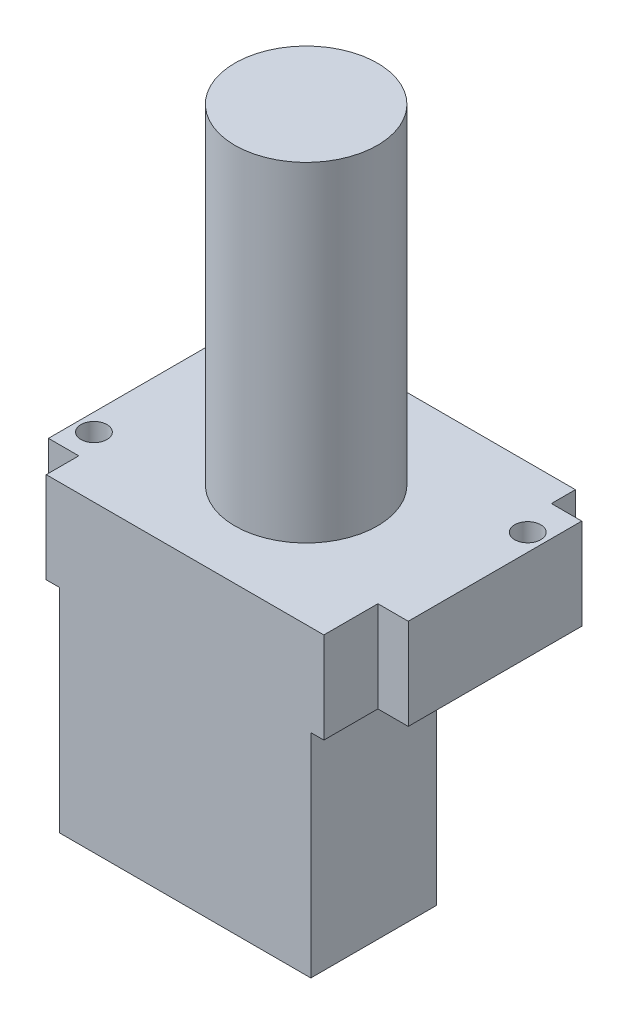
ISO-10303-21;
HEADER;
FILE_DESCRIPTION(('STEP AP214'),'2;1');
FILE_NAME('part.step','',(''),(''),'','','');
FILE_SCHEMA(('AUTOMOTIVE_DESIGN { 1 0 10303 214 1 1 1 1 }'));
ENDSEC;
DATA;
#1=APPLICATION_CONTEXT('core data for automotive mechanical design processes');
#2=APPLICATION_PROTOCOL_DEFINITION('international standard','automotive_design',2000,#1);
#3=PRODUCT_CONTEXT('',#1,'mechanical');
#4=PRODUCT('Part','Part','',(#3));
#5=PRODUCT_RELATED_PRODUCT_CATEGORY('part','',(#4));
#6=PRODUCT_DEFINITION_FORMATION('','',#4);
#7=PRODUCT_DEFINITION_CONTEXT('part definition',#1,'design');
#8=PRODUCT_DEFINITION('design','',#6,#7);
#9=PRODUCT_DEFINITION_SHAPE('','',#8);
#10=(LENGTH_UNIT() NAMED_UNIT(*) SI_UNIT(.MILLI.,.METRE.));
#11=(NAMED_UNIT(*) PLANE_ANGLE_UNIT() SI_UNIT($,.RADIAN.));
#12=(NAMED_UNIT(*) SI_UNIT($,.STERADIAN.) SOLID_ANGLE_UNIT());
#13=UNCERTAINTY_MEASURE_WITH_UNIT(LENGTH_MEASURE(1.E-05),#10,'distance_accuracy_value','');
#14=(GEOMETRIC_REPRESENTATION_CONTEXT(3) GLOBAL_UNCERTAINTY_ASSIGNED_CONTEXT((#13)) GLOBAL_UNIT_ASSIGNED_CONTEXT((#10,
#11,#12)) REPRESENTATION_CONTEXT('',''));
#15=CARTESIAN_POINT('',(0.,0.,0.));
#16=DIRECTION('',(0.,0.,1.));
#17=DIRECTION('',(1.,0.,0.));
#18=AXIS2_PLACEMENT_3D('',#15,#16,#17);
#19=CARTESIAN_POINT('',(-16.,35.,-21.75));
#20=DIRECTION('',(1.,0.,0.));
#21=DIRECTION('',(0.,0.,-1.));
#22=AXIS2_PLACEMENT_3D('',#19,#20,#21);
#23=PLANE('',#22);
#24=DIRECTION('',(0.,-1.,0.));
#25=VECTOR('',#24,1.);
#26=CARTESIAN_POINT('',(-16.,24.5,-16.5030809884463));
#27=LINE('',#26,#25);
#28=CARTESIAN_POINT('',(-16.,35.,-16.5030809884463));
#29=VERTEX_POINT('',#28);
#30=CARTESIAN_POINT('',(-16.,24.5,-16.5030809884463));
#31=VERTEX_POINT('',#30);
#32=EDGE_CURVE('E48',#29,#31,#27,.T.);
#33=ORIENTED_EDGE('',*,*,#32,.F.);
#34=DIRECTION('',(0.,0.,1.));
#35=VECTOR('',#34,1.);
#36=CARTESIAN_POINT('',(-16.,35.,-21.75));
#37=LINE('',#36,#35);
#38=CARTESIAN_POINT('',(-16.,35.,-21.75));
#39=VERTEX_POINT('',#38);
#40=EDGE_CURVE('E210',#39,#29,#37,.T.);
#41=ORIENTED_EDGE('',*,*,#40,.F.);
#42=DIRECTION('',(0.,-1.,0.));
#43=VECTOR('',#42,1.);
#44=CARTESIAN_POINT('',(-16.,35.,-21.75));
#45=LINE('',#44,#43);
#46=CARTESIAN_POINT('',(-16.,24.5,-21.75));
#47=VERTEX_POINT('',#46);
#48=EDGE_CURVE('E231',#39,#47,#45,.T.);
#49=ORIENTED_EDGE('',*,*,#48,.T.);
#50=DIRECTION('',(0.,0.,1.));
#51=VECTOR('',#50,1.);
#52=CARTESIAN_POINT('',(-16.,24.5,-21.75));
#53=LINE('',#52,#51);
#54=EDGE_CURVE('E220',#47,#31,#53,.T.);
#55=ORIENTED_EDGE('',*,*,#54,.T.);
#56=EDGE_LOOP('',(#33,#41,#49,#55));
#57=FACE_BOUND('',#56,.T.);
#58=ADVANCED_FACE('F33',(#57),#23,.F.);
#59=DIRECTION('',(0.,1.,0.));
#60=VECTOR('',#59,1.);
#61=CARTESIAN_POINT('',(-16.,24.5,3.49691901155367));
#62=LINE('',#61,#60);
#63=CARTESIAN_POINT('',(-16.,24.5,3.49691901155367));
#64=VERTEX_POINT('',#63);
#65=CARTESIAN_POINT('',(-16.,35.,3.49691901155367));
#66=VERTEX_POINT('',#65);
#67=EDGE_CURVE('E56',#64,#66,#62,.T.);
#68=ORIENTED_EDGE('',*,*,#67,.F.);
#69=CARTESIAN_POINT('',(-16.,24.5,7.25));
#70=VERTEX_POINT('',#69);
#71=EDGE_CURVE('E219',#64,#70,#53,.T.);
#72=ORIENTED_EDGE('',*,*,#71,.T.);
#73=DIRECTION('',(0.,-1.,0.));
#74=VECTOR('',#73,1.);
#75=CARTESIAN_POINT('',(-16.,35.,7.25));
#76=LINE('',#75,#74);
#77=CARTESIAN_POINT('',(-16.,35.,7.25));
#78=VERTEX_POINT('',#77);
#79=EDGE_CURVE('E228',#78,#70,#76,.T.);
#80=ORIENTED_EDGE('',*,*,#79,.F.);
#81=EDGE_CURVE('E209',#66,#78,#37,.T.);
#82=ORIENTED_EDGE('',*,*,#81,.F.);
#83=EDGE_LOOP('',(#68,#72,#80,#82));
#84=FACE_BOUND('',#83,.T.);
#85=ADVANCED_FACE('F365',(#84),#23,.F.);
#86=CARTESIAN_POINT('',(16.,35.,-21.75));
#87=DIRECTION('',(-1.,0.,0.));
#88=DIRECTION('',(0.,0.,1.));
#89=AXIS2_PLACEMENT_3D('',#86,#87,#88);
#90=PLANE('',#89);
#91=DIRECTION('',(0.,1.,0.));
#92=VECTOR('',#91,1.);
#93=CARTESIAN_POINT('',(16.,35.,-18.978907638751));
#94=LINE('',#93,#92);
#95=CARTESIAN_POINT('',(16.,24.5,-18.978907638751));
#96=VERTEX_POINT('',#95);
#97=CARTESIAN_POINT('',(16.,35.,-18.978907638751));
#98=VERTEX_POINT('',#97);
#99=EDGE_CURVE('E170',#96,#98,#94,.T.);
#100=ORIENTED_EDGE('',*,*,#99,.F.);
#101=DIRECTION('',(0.,0.,-1.));
#102=VECTOR('',#101,1.);
#103=CARTESIAN_POINT('',(16.,24.5,-21.75));
#104=LINE('',#103,#102);
#105=CARTESIAN_POINT('',(16.,24.5,-21.75));
#106=VERTEX_POINT('',#105);
#107=EDGE_CURVE('E202',#96,#106,#104,.T.);
#108=ORIENTED_EDGE('',*,*,#107,.T.);
#109=DIRECTION('',(0.,-1.,0.));
#110=VECTOR('',#109,1.);
#111=CARTESIAN_POINT('',(16.,35.,-21.75));
#112=LINE('',#111,#110);
#113=CARTESIAN_POINT('',(16.,35.,-21.75));
#114=VERTEX_POINT('',#113);
#115=EDGE_CURVE('E234',#114,#106,#112,.T.);
#116=ORIENTED_EDGE('',*,*,#115,.F.);
#117=DIRECTION('',(0.,0.,-1.));
#118=VECTOR('',#117,1.);
#119=CARTESIAN_POINT('',(16.,35.,-21.75));
#120=LINE('',#119,#118);
#121=EDGE_CURVE('E207',#98,#114,#120,.T.);
#122=ORIENTED_EDGE('',*,*,#121,.F.);
#123=EDGE_LOOP('',(#100,#108,#116,#122));
#124=FACE_BOUND('',#123,.T.);
#125=ADVANCED_FACE('F299',(#124),#90,.F.);
#126=DIRECTION('',(0.,-1.,0.));
#127=VECTOR('',#126,1.);
#128=CARTESIAN_POINT('',(16.,35.,1.02109236124903));
#129=LINE('',#128,#127);
#130=CARTESIAN_POINT('',(16.,35.,1.02109236124903));
#131=VERTEX_POINT('',#130);
#132=CARTESIAN_POINT('',(16.,24.5,1.02109236124903));
#133=VERTEX_POINT('',#132);
#134=EDGE_CURVE('E173',#131,#133,#129,.T.);
#135=ORIENTED_EDGE('',*,*,#134,.F.);
#136=CARTESIAN_POINT('',(16.,35.,7.25));
#137=VERTEX_POINT('',#136);
#138=EDGE_CURVE('E203',#137,#131,#120,.T.);
#139=ORIENTED_EDGE('',*,*,#138,.F.);
#140=DIRECTION('',(0.,-1.,0.));
#141=VECTOR('',#140,1.);
#142=CARTESIAN_POINT('',(16.,35.,7.25));
#143=LINE('',#142,#141);
#144=CARTESIAN_POINT('',(16.,24.5,7.25));
#145=VERTEX_POINT('',#144);
#146=EDGE_CURVE('E214',#137,#145,#143,.T.);
#147=ORIENTED_EDGE('',*,*,#146,.T.);
#148=EDGE_CURVE('E215',#145,#133,#104,.T.);
#149=ORIENTED_EDGE('',*,*,#148,.T.);
#150=EDGE_LOOP('',(#135,#139,#147,#149));
#151=FACE_BOUND('',#150,.T.);
#152=ADVANCED_FACE('F280',(#151),#90,.F.);
#153=CARTESIAN_POINT('',(14.5,24.5,-7.25));
#154=DIRECTION('',(-1.,0.,0.));
#155=DIRECTION('',(0.,0.,1.));
#156=AXIS2_PLACEMENT_3D('',#153,#154,#155);
#157=PLANE('',#156);
#158=DIRECTION('',(0.,0.,-1.));
#159=VECTOR('',#158,1.);
#160=CARTESIAN_POINT('',(14.5,0.,-7.25));
#161=LINE('',#160,#159);
#162=CARTESIAN_POINT('',(14.5,0.,7.25));
#163=VERTEX_POINT('',#162);
#164=CARTESIAN_POINT('',(14.5,0.,-7.25));
#165=VERTEX_POINT('',#164);
#166=EDGE_CURVE('E237',#163,#165,#161,.T.);
#167=ORIENTED_EDGE('',*,*,#166,.T.);
#168=DIRECTION('',(0.,-1.,0.));
#169=VECTOR('',#168,1.);
#170=CARTESIAN_POINT('',(14.5,24.5,-7.25));
#171=LINE('',#170,#169);
#172=CARTESIAN_POINT('',(14.5,24.5,-7.25));
#173=VERTEX_POINT('',#172);
#174=EDGE_CURVE('E11',#173,#165,#171,.T.);
#175=ORIENTED_EDGE('',*,*,#174,.F.);
#176=DIRECTION('',(0.,0.,-1.));
#177=VECTOR('',#176,1.);
#178=CARTESIAN_POINT('',(14.5,24.5,-7.25));
#179=LINE('',#178,#177);
#180=CARTESIAN_POINT('',(14.5,24.5,7.25));
#181=VERTEX_POINT('',#180);
#182=EDGE_CURVE('E238',#181,#173,#179,.T.);
#183=ORIENTED_EDGE('',*,*,#182,.F.);
#184=DIRECTION('',(0.,-1.,0.));
#185=VECTOR('',#184,1.);
#186=CARTESIAN_POINT('',(14.5,24.5,7.25));
#187=LINE('',#186,#185);
#188=EDGE_CURVE('E248',#181,#163,#187,.T.);
#189=ORIENTED_EDGE('',*,*,#188,.T.);
#190=EDGE_LOOP('',(#167,#175,#183,#189));
#191=FACE_BOUND('',#190,.T.);
#192=ADVANCED_FACE('F35',(#191),#157,.F.);
#193=CARTESIAN_POINT('',(-14.5,24.5,-7.25));
#194=DIRECTION('',(0.,0.,1.));
#195=DIRECTION('',(1.,0.,0.));
#196=AXIS2_PLACEMENT_3D('',#193,#194,#195);
#197=PLANE('',#196);
#198=DIRECTION('',(-1.,0.,0.));
#199=VECTOR('',#198,1.);
#200=CARTESIAN_POINT('',(-14.5,0.,-7.25));
#201=LINE('',#200,#199);
#202=CARTESIAN_POINT('',(-14.5,0.,-7.25));
#203=VERTEX_POINT('',#202);
#204=EDGE_CURVE('E251',#165,#203,#201,.T.);
#205=ORIENTED_EDGE('',*,*,#204,.T.);
#206=DIRECTION('',(0.,-1.,0.));
#207=VECTOR('',#206,1.);
#208=CARTESIAN_POINT('',(-14.5,24.5,-7.25));
#209=LINE('',#208,#207);
#210=CARTESIAN_POINT('',(-14.5,24.5,-7.25));
#211=VERTEX_POINT('',#210);
#212=EDGE_CURVE('E41',#211,#203,#209,.T.);
#213=ORIENTED_EDGE('',*,*,#212,.F.);
#214=DIRECTION('',(-1.,0.,0.));
#215=VECTOR('',#214,1.);
#216=CARTESIAN_POINT('',(-14.5,24.5,-7.25));
#217=LINE('',#216,#215);
#218=EDGE_CURVE('E241',#173,#211,#217,.T.);
#219=ORIENTED_EDGE('',*,*,#218,.F.);
#220=ORIENTED_EDGE('',*,*,#174,.T.);
#221=EDGE_LOOP('',(#205,#213,#219,#220));
#222=FACE_BOUND('',#221,.T.);
#223=ADVANCED_FACE('F375',(#222),#197,.F.);
#224=CARTESIAN_POINT('',(-14.5,24.5,-7.25));
#225=DIRECTION('',(1.,0.,0.));
#226=DIRECTION('',(0.,0.,-1.));
#227=AXIS2_PLACEMENT_3D('',#224,#225,#226);
#228=PLANE('',#227);
#229=DIRECTION('',(0.,0.,1.));
#230=VECTOR('',#229,1.);
#231=CARTESIAN_POINT('',(-14.5,0.,-7.25));
#232=LINE('',#231,#230);
#233=CARTESIAN_POINT('',(-14.5,0.,7.25));
#234=VERTEX_POINT('',#233);
#235=EDGE_CURVE('E253',#203,#234,#232,.T.);
#236=ORIENTED_EDGE('',*,*,#235,.T.);
#237=DIRECTION('',(0.,-1.,0.));
#238=VECTOR('',#237,1.);
#239=CARTESIAN_POINT('',(-14.5,24.5,7.25));
#240=LINE('',#239,#238);
#241=CARTESIAN_POINT('',(-14.5,24.5,7.25));
#242=VERTEX_POINT('',#241);
#243=EDGE_CURVE('E258',#242,#234,#240,.T.);
#244=ORIENTED_EDGE('',*,*,#243,.F.);
#245=DIRECTION('',(0.,0.,1.));
#246=VECTOR('',#245,1.);
#247=CARTESIAN_POINT('',(-14.5,24.5,-7.25));
#248=LINE('',#247,#246);
#249=EDGE_CURVE('E245',#211,#242,#248,.T.);
#250=ORIENTED_EDGE('',*,*,#249,.F.);
#251=ORIENTED_EDGE('',*,*,#212,.T.);
#252=EDGE_LOOP('',(#236,#244,#250,#251));
#253=FACE_BOUND('',#252,.T.);
#254=ADVANCED_FACE('F264',(#253),#228,.F.);
#255=CARTESIAN_POINT('',(-14.5,24.5,7.25));
#256=DIRECTION('',(0.,0.,-1.));
#257=DIRECTION('',(-1.,0.,0.));
#258=AXIS2_PLACEMENT_3D('',#255,#256,#257);
#259=PLANE('',#258);
#260=DIRECTION('',(1.,0.,0.));
#261=VECTOR('',#260,1.);
#262=CARTESIAN_POINT('',(-14.5,0.,7.25));
#263=LINE('',#262,#261);
#264=EDGE_CURVE('E242',#234,#163,#263,.T.);
#265=ORIENTED_EDGE('',*,*,#264,.T.);
#266=ORIENTED_EDGE('',*,*,#188,.F.);
#267=DIRECTION('',(1.,0.,0.));
#268=VECTOR('',#267,1.);
#269=CARTESIAN_POINT('',(-16.,24.5,7.25));
#270=LINE('',#269,#268);
#271=EDGE_CURVE('E222',#181,#145,#270,.T.);
#272=ORIENTED_EDGE('',*,*,#271,.T.);
#273=ORIENTED_EDGE('',*,*,#146,.F.);
#274=DIRECTION('',(1.,0.,0.));
#275=VECTOR('',#274,1.);
#276=CARTESIAN_POINT('',(-16.,35.,7.25));
#277=LINE('',#276,#275);
#278=EDGE_CURVE('E212',#78,#137,#277,.T.);
#279=ORIENTED_EDGE('',*,*,#278,.F.);
#280=ORIENTED_EDGE('',*,*,#79,.T.);
#281=EDGE_CURVE('E223',#70,#242,#270,.T.);
#282=ORIENTED_EDGE('',*,*,#281,.T.);
#283=ORIENTED_EDGE('',*,*,#243,.T.);
#284=EDGE_LOOP('',(#265,#266,#272,#273,#279,#280,#282,#283));
#285=FACE_BOUND('',#284,.T.);
#286=ADVANCED_FACE('F271',(#285),#259,.F.);
#287=CARTESIAN_POINT('',(0.,0.,0.));
#288=DIRECTION('',(0.,1.,0.));
#289=DIRECTION('',(0.,0.,1.));
#290=AXIS2_PLACEMENT_3D('',#287,#288,#289);
#291=PLANE('',#290);
#292=ORIENTED_EDGE('',*,*,#166,.F.);
#293=ORIENTED_EDGE('',*,*,#264,.F.);
#294=ORIENTED_EDGE('',*,*,#235,.F.);
#295=ORIENTED_EDGE('',*,*,#204,.F.);
#296=EDGE_LOOP('',(#292,#293,#294,#295));
#297=FACE_BOUND('',#296,.T.);
#298=ADVANCED_FACE('F269',(#297),#291,.F.);
#299=CARTESIAN_POINT('',(0.,24.5,0.));
#300=DIRECTION('',(0.,1.,0.));
#301=DIRECTION('',(0.,0.,1.));
#302=AXIS2_PLACEMENT_3D('',#299,#300,#301);
#303=PLANE('',#302);
#304=CARTESIAN_POINT('',(-17.5,24.5,0.249999999999999));
#305=DIRECTION('',(0.,1.,0.));
#306=DIRECTION('',(0.,0.,1.));
#307=AXIS2_PLACEMENT_3D('',#304,#305,#306);
#308=CIRCLE('',#307,1.5);
#309=CARTESIAN_POINT('',(-17.5,24.5,1.75));
#310=VERTEX_POINT('',#309);
#311=EDGE_CURVE('E319',#310,#310,#308,.T.);
#312=ORIENTED_EDGE('',*,*,#311,.T.);
#313=EDGE_LOOP('',(#312));
#314=FACE_BOUND('',#313,.T.);
#315=CARTESIAN_POINT('',(17.5,24.5,-14.75));
#316=DIRECTION('',(0.,1.,0.));
#317=DIRECTION('',(0.,0.,1.));
#318=AXIS2_PLACEMENT_3D('',#315,#316,#317);
#319=CIRCLE('',#318,1.5);
#320=CARTESIAN_POINT('',(17.5,24.5,-13.25));
#321=VERTEX_POINT('',#320);
#322=EDGE_CURVE('E311',#321,#321,#319,.T.);
#323=ORIENTED_EDGE('',*,*,#322,.T.);
#324=EDGE_LOOP('',(#323));
#325=FACE_BOUND('',#324,.T.);
#326=ORIENTED_EDGE('',*,*,#271,.F.);
#327=ORIENTED_EDGE('',*,*,#182,.T.);
#328=ORIENTED_EDGE('',*,*,#218,.T.);
#329=ORIENTED_EDGE('',*,*,#249,.T.);
#330=ORIENTED_EDGE('',*,*,#281,.F.);
#331=ORIENTED_EDGE('',*,*,#71,.F.);
#332=DIRECTION('',(1.,0.,0.));
#333=VECTOR('',#332,1.);
#334=CARTESIAN_POINT('',(-19.5,24.5,3.49691901155367));
#335=LINE('',#334,#333);
#336=CARTESIAN_POINT('',(-19.5,24.5,3.49691901155367));
#337=VERTEX_POINT('',#336);
#338=EDGE_CURVE('E155',#337,#64,#335,.T.);
#339=ORIENTED_EDGE('',*,*,#338,.F.);
#340=DIRECTION('',(0.,0.,1.));
#341=VECTOR('',#340,1.);
#342=CARTESIAN_POINT('',(-19.5,24.5,-16.5030809884463));
#343=LINE('',#342,#341);
#344=CARTESIAN_POINT('',(-19.5,24.5,-16.5030809884463));
#345=VERTEX_POINT('',#344);
#346=EDGE_CURVE('E147',#345,#337,#343,.T.);
#347=ORIENTED_EDGE('',*,*,#346,.F.);
#348=DIRECTION('',(1.,0.,0.));
#349=VECTOR('',#348,1.);
#350=CARTESIAN_POINT('',(-19.5,24.5,-16.5030809884463));
#351=LINE('',#350,#349);
#352=EDGE_CURVE('E153',#345,#31,#351,.T.);
#353=ORIENTED_EDGE('',*,*,#352,.T.);
#354=ORIENTED_EDGE('',*,*,#54,.F.);
#355=DIRECTION('',(-1.,0.,0.));
#356=VECTOR('',#355,1.);
#357=CARTESIAN_POINT('',(-16.,24.5,-21.75));
#358=LINE('',#357,#356);
#359=EDGE_CURVE('E217',#106,#47,#358,.T.);
#360=ORIENTED_EDGE('',*,*,#359,.F.);
#361=ORIENTED_EDGE('',*,*,#107,.F.);
#362=DIRECTION('',(-1.,0.,0.));
#363=VECTOR('',#362,1.);
#364=CARTESIAN_POINT('',(19.5,24.5,-18.978907638751));
#365=LINE('',#364,#363);
#366=CARTESIAN_POINT('',(19.5,24.5,-18.978907638751));
#367=VERTEX_POINT('',#366);
#368=EDGE_CURVE('E187',#367,#96,#365,.T.);
#369=ORIENTED_EDGE('',*,*,#368,.F.);
#370=DIRECTION('',(0.,0.,-1.));
#371=VECTOR('',#370,1.);
#372=CARTESIAN_POINT('',(19.5,24.5,-18.978907638751));
#373=LINE('',#372,#371);
#374=CARTESIAN_POINT('',(19.5,24.5,1.02109236124903));
#375=VERTEX_POINT('',#374);
#376=EDGE_CURVE('E186',#375,#367,#373,.T.);
#377=ORIENTED_EDGE('',*,*,#376,.F.);
#378=DIRECTION('',(-1.,0.,0.));
#379=VECTOR('',#378,1.);
#380=CARTESIAN_POINT('',(19.5,24.5,1.02109236124903));
#381=LINE('',#380,#379);
#382=EDGE_CURVE('E193',#375,#133,#381,.T.);
#383=ORIENTED_EDGE('',*,*,#382,.T.);
#384=ORIENTED_EDGE('',*,*,#148,.F.);
#385=EDGE_LOOP('',(#326,#327,#328,#329,#330,#331,#339,#347,#353,#354,#360,#361,#369,#377,#383,#384));
#386=FACE_BOUND('',#385,.T.);
#387=ADVANCED_FACE('F150',(#314,#325,#386),#303,.F.);
#388=CARTESIAN_POINT('',(-16.,35.,-21.75));
#389=DIRECTION('',(0.,0.,1.));
#390=DIRECTION('',(1.,0.,0.));
#391=AXIS2_PLACEMENT_3D('',#388,#389,#390);
#392=PLANE('',#391);
#393=ORIENTED_EDGE('',*,*,#359,.T.);
#394=ORIENTED_EDGE('',*,*,#48,.F.);
#395=DIRECTION('',(-1.,0.,0.));
#396=VECTOR('',#395,1.);
#397=CARTESIAN_POINT('',(-16.,35.,-21.75));
#398=LINE('',#397,#396);
#399=EDGE_CURVE('E206',#114,#39,#398,.T.);
#400=ORIENTED_EDGE('',*,*,#399,.F.);
#401=ORIENTED_EDGE('',*,*,#115,.T.);
#402=EDGE_LOOP('',(#393,#394,#400,#401));
#403=FACE_BOUND('',#402,.T.);
#404=ADVANCED_FACE('F304',(#403),#392,.F.);
#405=CARTESIAN_POINT('',(0.,35.,0.));
#406=DIRECTION('',(0.,1.,0.));
#407=DIRECTION('',(0.,0.,1.));
#408=AXIS2_PLACEMENT_3D('',#405,#406,#407);
#409=PLANE('',#408);
#410=CARTESIAN_POINT('',(0.,35.,-6.70950082268718));
#411=DIRECTION('',(0.,1.,0.));
#412=DIRECTION('',(0.,0.,1.));
#413=AXIS2_PLACEMENT_3D('',#410,#411,#412);
#414=CIRCLE('',#413,8.21711537927371);
#415=CARTESIAN_POINT('',(0.,35.,1.50761455658654));
#416=VERTEX_POINT('',#415);
#417=EDGE_CURVE('E326',#416,#416,#414,.T.);
#418=ORIENTED_EDGE('',*,*,#417,.F.);
#419=EDGE_LOOP('',(#418));
#420=FACE_BOUND('',#419,.T.);
#421=CARTESIAN_POINT('',(-17.5,35.,0.249999999999999));
#422=DIRECTION('',(0.,1.,0.));
#423=DIRECTION('',(0.,0.,1.));
#424=AXIS2_PLACEMENT_3D('',#421,#422,#423);
#425=CIRCLE('',#424,1.5);
#426=CARTESIAN_POINT('',(-17.5,35.,1.75));
#427=VERTEX_POINT('',#426);
#428=EDGE_CURVE('E322',#427,#427,#425,.T.);
#429=ORIENTED_EDGE('',*,*,#428,.F.);
#430=EDGE_LOOP('',(#429));
#431=FACE_BOUND('',#430,.T.);
#432=CARTESIAN_POINT('',(17.5,35.,-14.75));
#433=DIRECTION('',(0.,1.,0.));
#434=DIRECTION('',(0.,0.,1.));
#435=AXIS2_PLACEMENT_3D('',#432,#433,#434);
#436=CIRCLE('',#435,1.5);
#437=CARTESIAN_POINT('',(17.5,35.,-13.25));
#438=VERTEX_POINT('',#437);
#439=EDGE_CURVE('E316',#438,#438,#436,.T.);
#440=ORIENTED_EDGE('',*,*,#439,.F.);
#441=EDGE_LOOP('',(#440));
#442=FACE_BOUND('',#441,.T.);
#443=ORIENTED_EDGE('',*,*,#138,.T.);
#444=DIRECTION('',(-1.,0.,0.));
#445=VECTOR('',#444,1.);
#446=CARTESIAN_POINT('',(19.5,35.,1.02109236124903));
#447=LINE('',#446,#445);
#448=CARTESIAN_POINT('',(19.5,35.,1.02109236124903));
#449=VERTEX_POINT('',#448);
#450=EDGE_CURVE('E196',#449,#131,#447,.T.);
#451=ORIENTED_EDGE('',*,*,#450,.F.);
#452=DIRECTION('',(0.,0.,1.));
#453=VECTOR('',#452,1.);
#454=CARTESIAN_POINT('',(19.5,35.,-18.978907638751));
#455=LINE('',#454,#453);
#456=CARTESIAN_POINT('',(19.5,35.,-18.978907638751));
#457=VERTEX_POINT('',#456);
#458=EDGE_CURVE('E182',#457,#449,#455,.T.);
#459=ORIENTED_EDGE('',*,*,#458,.F.);
#460=DIRECTION('',(-1.,0.,0.));
#461=VECTOR('',#460,1.);
#462=CARTESIAN_POINT('',(19.5,35.,-18.978907638751));
#463=LINE('',#462,#461);
#464=EDGE_CURVE('E199',#457,#98,#463,.T.);
#465=ORIENTED_EDGE('',*,*,#464,.T.);
#466=ORIENTED_EDGE('',*,*,#121,.T.);
#467=ORIENTED_EDGE('',*,*,#399,.T.);
#468=ORIENTED_EDGE('',*,*,#40,.T.);
#469=DIRECTION('',(1.,0.,0.));
#470=VECTOR('',#469,1.);
#471=CARTESIAN_POINT('',(-19.5,35.,-16.5030809884463));
#472=LINE('',#471,#470);
#473=CARTESIAN_POINT('',(-19.5,35.,-16.5030809884463));
#474=VERTEX_POINT('',#473);
#475=EDGE_CURVE('E305',#474,#29,#472,.T.);
#476=ORIENTED_EDGE('',*,*,#475,.F.);
#477=DIRECTION('',(0.,0.,-1.));
#478=VECTOR('',#477,1.);
#479=CARTESIAN_POINT('',(-19.5,35.,-16.5030809884463));
#480=LINE('',#479,#478);
#481=CARTESIAN_POINT('',(-19.5,35.,3.49691901155367));
#482=VERTEX_POINT('',#481);
#483=EDGE_CURVE('E164',#482,#474,#480,.T.);
#484=ORIENTED_EDGE('',*,*,#483,.F.);
#485=DIRECTION('',(1.,0.,0.));
#486=VECTOR('',#485,1.);
#487=CARTESIAN_POINT('',(-19.5,35.,3.49691901155367));
#488=LINE('',#487,#486);
#489=EDGE_CURVE('E175',#482,#66,#488,.T.);
#490=ORIENTED_EDGE('',*,*,#489,.T.);
#491=ORIENTED_EDGE('',*,*,#81,.T.);
#492=ORIENTED_EDGE('',*,*,#278,.T.);
#493=EDGE_LOOP('',(#443,#451,#459,#465,#466,#467,#468,#476,#484,#490,#491,#492));
#494=FACE_BOUND('',#493,.T.);
#495=ADVANCED_FACE('F283',(#420,#431,#442,#494),#409,.T.);
#496=CARTESIAN_POINT('',(19.5,35.,-18.978907638751));
#497=DIRECTION('',(0.,0.,1.));
#498=DIRECTION('',(1.,0.,0.));
#499=AXIS2_PLACEMENT_3D('',#496,#497,#498);
#500=PLANE('',#499);
#501=ORIENTED_EDGE('',*,*,#99,.T.);
#502=ORIENTED_EDGE('',*,*,#464,.F.);
#503=DIRECTION('',(0.,1.,0.));
#504=VECTOR('',#503,1.);
#505=CARTESIAN_POINT('',(19.5,35.,-18.978907638751));
#506=LINE('',#505,#504);
#507=EDGE_CURVE('E179',#367,#457,#506,.T.);
#508=ORIENTED_EDGE('',*,*,#507,.F.);
#509=ORIENTED_EDGE('',*,*,#368,.T.);
#510=EDGE_LOOP('',(#501,#502,#508,#509));
#511=FACE_BOUND('',#510,.T.);
#512=ADVANCED_FACE('F296',(#511),#500,.F.);
#513=CARTESIAN_POINT('',(19.5,35.,1.02109236124903));
#514=DIRECTION('',(0.,0.,-1.));
#515=DIRECTION('',(-1.,0.,0.));
#516=AXIS2_PLACEMENT_3D('',#513,#514,#515);
#517=PLANE('',#516);
#518=ORIENTED_EDGE('',*,*,#134,.T.);
#519=ORIENTED_EDGE('',*,*,#382,.F.);
#520=DIRECTION('',(0.,-1.,0.));
#521=VECTOR('',#520,1.);
#522=CARTESIAN_POINT('',(19.5,35.,1.02109236124903));
#523=LINE('',#522,#521);
#524=EDGE_CURVE('E184',#449,#375,#523,.T.);
#525=ORIENTED_EDGE('',*,*,#524,.F.);
#526=ORIENTED_EDGE('',*,*,#450,.T.);
#527=EDGE_LOOP('',(#518,#519,#525,#526));
#528=FACE_BOUND('',#527,.T.);
#529=ADVANCED_FACE('F286',(#528),#517,.F.);
#530=CARTESIAN_POINT('',(19.5,0.,0.));
#531=DIRECTION('',(-1.,0.,0.));
#532=DIRECTION('',(0.,0.,1.));
#533=AXIS2_PLACEMENT_3D('',#530,#531,#532);
#534=PLANE('',#533);
#535=ORIENTED_EDGE('',*,*,#507,.T.);
#536=ORIENTED_EDGE('',*,*,#458,.T.);
#537=ORIENTED_EDGE('',*,*,#524,.T.);
#538=ORIENTED_EDGE('',*,*,#376,.T.);
#539=EDGE_LOOP('',(#535,#536,#537,#538));
#540=FACE_BOUND('',#539,.T.);
#541=ADVANCED_FACE('F290',(#540),#534,.F.);
#542=CARTESIAN_POINT('',(-19.5,24.5,-16.5030809884463));
#543=DIRECTION('',(0.,0.,1.));
#544=DIRECTION('',(1.,0.,0.));
#545=AXIS2_PLACEMENT_3D('',#542,#543,#544);
#546=PLANE('',#545);
#547=ORIENTED_EDGE('',*,*,#32,.T.);
#548=ORIENTED_EDGE('',*,*,#352,.F.);
#549=DIRECTION('',(0.,-1.,0.));
#550=VECTOR('',#549,1.);
#551=CARTESIAN_POINT('',(-19.5,24.5,-16.5030809884463));
#552=LINE('',#551,#550);
#553=EDGE_CURVE('E159',#474,#345,#552,.T.);
#554=ORIENTED_EDGE('',*,*,#553,.F.);
#555=ORIENTED_EDGE('',*,*,#475,.T.);
#556=EDGE_LOOP('',(#547,#548,#554,#555));
#557=FACE_BOUND('',#556,.T.);
#558=ADVANCED_FACE('F169',(#557),#546,.F.);
#559=CARTESIAN_POINT('',(-19.5,24.5,3.49691901155367));
#560=DIRECTION('',(0.,0.,-1.));
#561=DIRECTION('',(-1.,0.,0.));
#562=AXIS2_PLACEMENT_3D('',#559,#560,#561);
#563=PLANE('',#562);
#564=ORIENTED_EDGE('',*,*,#67,.T.);
#565=ORIENTED_EDGE('',*,*,#489,.F.);
#566=DIRECTION('',(0.,1.,0.));
#567=VECTOR('',#566,1.);
#568=CARTESIAN_POINT('',(-19.5,24.5,3.49691901155367));
#569=LINE('',#568,#567);
#570=EDGE_CURVE('E158',#337,#482,#569,.T.);
#571=ORIENTED_EDGE('',*,*,#570,.F.);
#572=ORIENTED_EDGE('',*,*,#338,.T.);
#573=EDGE_LOOP('',(#564,#565,#571,#572));
#574=FACE_BOUND('',#573,.T.);
#575=ADVANCED_FACE('F383',(#574),#563,.F.);
#576=CARTESIAN_POINT('',(-19.5,0.,0.));
#577=DIRECTION('',(1.,0.,0.));
#578=DIRECTION('',(0.,0.,-1.));
#579=AXIS2_PLACEMENT_3D('',#576,#577,#578);
#580=PLANE('',#579);
#581=ORIENTED_EDGE('',*,*,#553,.T.);
#582=ORIENTED_EDGE('',*,*,#346,.T.);
#583=ORIENTED_EDGE('',*,*,#570,.T.);
#584=ORIENTED_EDGE('',*,*,#483,.T.);
#585=EDGE_LOOP('',(#581,#582,#583,#584));
#586=FACE_BOUND('',#585,.T.);
#587=ADVANCED_FACE('F162',(#586),#580,.F.);
#588=CARTESIAN_POINT('',(17.5,0.,-14.75));
#589=DIRECTION('',(0.,1.,0.));
#590=DIRECTION('',(0.,0.,1.));
#591=AXIS2_PLACEMENT_3D('',#588,#589,#590);
#592=CYLINDRICAL_SURFACE('',#591,1.5);
#593=ORIENTED_EDGE('',*,*,#439,.T.);
#594=EDGE_LOOP('',(#593));
#595=FACE_BOUND('',#594,.T.);
#596=ORIENTED_EDGE('',*,*,#322,.F.);
#597=EDGE_LOOP('',(#596));
#598=FACE_BOUND('',#597,.T.);
#599=ADVANCED_FACE('F348',(#595,#598),#592,.F.);
#600=CARTESIAN_POINT('',(-17.5,0.,0.249999999999999));
#601=DIRECTION('',(0.,1.,0.));
#602=DIRECTION('',(0.,0.,1.));
#603=AXIS2_PLACEMENT_3D('',#600,#601,#602);
#604=CYLINDRICAL_SURFACE('',#603,1.5);
#605=ORIENTED_EDGE('',*,*,#428,.T.);
#606=EDGE_LOOP('',(#605));
#607=FACE_BOUND('',#606,.T.);
#608=ORIENTED_EDGE('',*,*,#311,.F.);
#609=EDGE_LOOP('',(#608));
#610=FACE_BOUND('',#609,.T.);
#611=ADVANCED_FACE('F337',(#607,#610),#604,.F.);
#612=CARTESIAN_POINT('',(0.,73.,-6.70950082268718));
#613=DIRECTION('',(0.,-1.,0.));
#614=DIRECTION('',(0.,0.,-1.));
#615=AXIS2_PLACEMENT_3D('',#612,#613,#614);
#616=CYLINDRICAL_SURFACE('',#615,8.21711537927371);
#617=CARTESIAN_POINT('',(0.,73.,-6.70950082268718));
#618=DIRECTION('',(0.,1.,0.));
#619=DIRECTION('',(0.,0.,1.));
#620=AXIS2_PLACEMENT_3D('',#617,#618,#619);
#621=CIRCLE('',#620,8.21711537927371);
#622=CARTESIAN_POINT('',(0.,73.,1.50761455658654));
#623=VERTEX_POINT('',#622);
#624=EDGE_CURVE('E325',#623,#623,#621,.T.);
#625=ORIENTED_EDGE('',*,*,#624,.F.);
#626=EDGE_LOOP('',(#625));
#627=FACE_BOUND('',#626,.T.);
#628=ORIENTED_EDGE('',*,*,#417,.T.);
#629=EDGE_LOOP('',(#628));
#630=FACE_BOUND('',#629,.T.);
#631=ADVANCED_FACE('F334',(#627,#630),#616,.T.);
#632=CARTESIAN_POINT('',(0.,73.,-6.70950082268718));
#633=DIRECTION('',(0.,1.,0.));
#634=DIRECTION('',(0.,0.,1.));
#635=AXIS2_PLACEMENT_3D('',#632,#633,#634);
#636=PLANE('',#635);
#637=ORIENTED_EDGE('',*,*,#624,.T.);
#638=EDGE_LOOP('',(#637));
#639=FACE_BOUND('',#638,.T.);
#640=ADVANCED_FACE('F332',(#639),#636,.T.);
#641=CLOSED_SHELL('',(#58,#85,#125,#152,#192,#223,#254,#286,#298,#387,#404,#495,#512,#529,#541,
#558,#575,#587,#599,#611,#631,#640));
#642=MANIFOLD_SOLID_BREP('B2',#641);
#643=ADVANCED_BREP_SHAPE_REPRESENTATION('',(#18,#642),#14);
#644=SHAPE_DEFINITION_REPRESENTATION(#9,#643);
ENDSEC;
END-ISO-10303-21;
